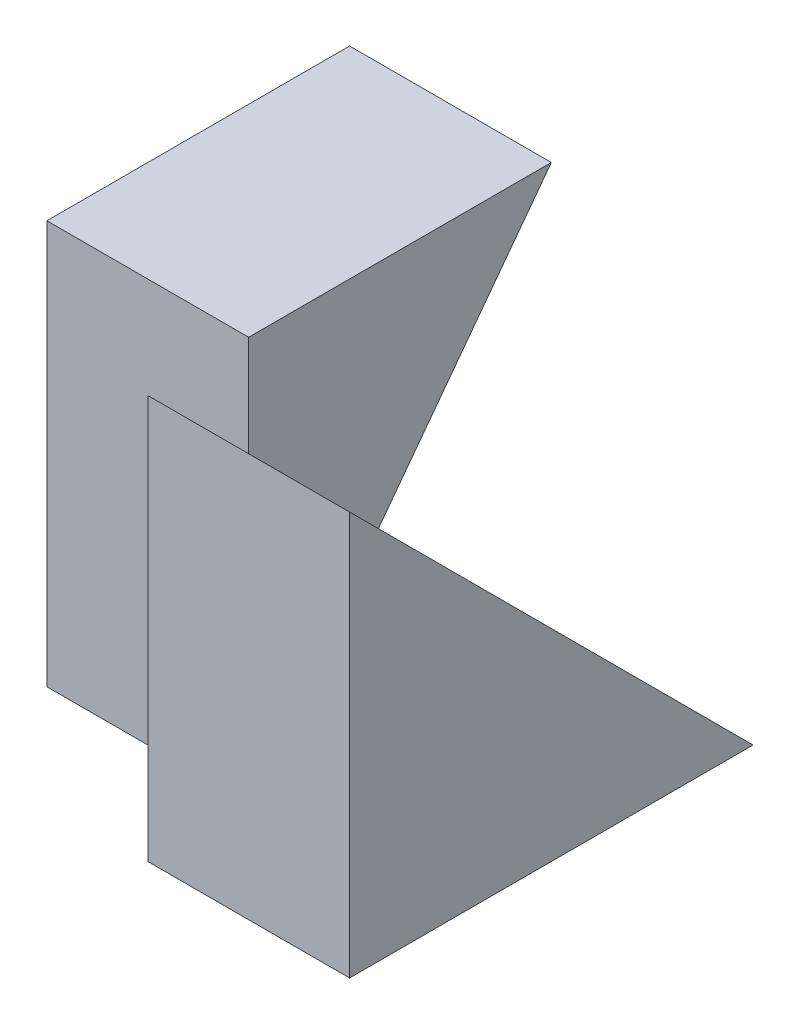
ISO-10303-21;
HEADER;
FILE_DESCRIPTION(('STEP AP214'),'2;1');
FILE_NAME('part.step','',(''),(''),'','','');
FILE_SCHEMA(('AUTOMOTIVE_DESIGN { 1 0 10303 214 1 1 1 1 }'));
ENDSEC;
DATA;
#1=APPLICATION_CONTEXT('core data for automotive mechanical design processes');
#2=APPLICATION_PROTOCOL_DEFINITION('international standard','automotive_design',2000,#1);
#3=PRODUCT_CONTEXT('',#1,'mechanical');
#4=PRODUCT('Part','Part','',(#3));
#5=PRODUCT_RELATED_PRODUCT_CATEGORY('part','',(#4));
#6=PRODUCT_DEFINITION_FORMATION('','',#4);
#7=PRODUCT_DEFINITION_CONTEXT('part definition',#1,'design');
#8=PRODUCT_DEFINITION('design','',#6,#7);
#9=PRODUCT_DEFINITION_SHAPE('','',#8);
#10=(LENGTH_UNIT() NAMED_UNIT(*) SI_UNIT(.MILLI.,.METRE.));
#11=(NAMED_UNIT(*) PLANE_ANGLE_UNIT() SI_UNIT($,.RADIAN.));
#12=(NAMED_UNIT(*) SI_UNIT($,.STERADIAN.) SOLID_ANGLE_UNIT());
#13=UNCERTAINTY_MEASURE_WITH_UNIT(LENGTH_MEASURE(1.E-05),#10,'distance_accuracy_value','');
#14=(GEOMETRIC_REPRESENTATION_CONTEXT(3) GLOBAL_UNCERTAINTY_ASSIGNED_CONTEXT((#13)) GLOBAL_UNIT_ASSIGNED_CONTEXT((#10,
#11,#12)) REPRESENTATION_CONTEXT('',''));
#15=CARTESIAN_POINT('',(0.,0.,0.));
#16=DIRECTION('',(0.,0.,1.));
#17=DIRECTION('',(1.,0.,0.));
#18=AXIS2_PLACEMENT_3D('',#15,#16,#17);
#19=CARTESIAN_POINT('',(2.,0.,0.));
#20=DIRECTION('',(0.,1.,0.));
#21=DIRECTION('',(0.,0.,1.));
#22=AXIS2_PLACEMENT_3D('',#19,#20,#21);
#23=PLANE('',#22);
#24=DIRECTION('',(0.,0.,1.));
#25=VECTOR('',#24,1.);
#26=CARTESIAN_POINT('',(0.,0.,0.));
#27=LINE('',#26,#25);
#28=CARTESIAN_POINT('',(0.,0.,-4.));
#29=VERTEX_POINT('',#28);
#30=CARTESIAN_POINT('',(0.,0.,-1.));
#31=VERTEX_POINT('',#30);
#32=EDGE_CURVE('E103',#29,#31,#27,.T.);
#33=ORIENTED_EDGE('',*,*,#32,.F.);
#34=DIRECTION('',(-1.,0.,0.));
#35=VECTOR('',#34,1.);
#36=CARTESIAN_POINT('',(2.,0.,-4.));
#37=LINE('',#36,#35);
#38=CARTESIAN_POINT('',(2.,0.,-4.));
#39=VERTEX_POINT('',#38);
#40=EDGE_CURVE('E42',#39,#29,#37,.T.);
#41=ORIENTED_EDGE('',*,*,#40,.F.);
#42=DIRECTION('',(0.,0.,-1.));
#43=VECTOR('',#42,1.);
#44=CARTESIAN_POINT('',(2.,0.,0.));
#45=LINE('',#44,#43);
#46=CARTESIAN_POINT('',(2.,0.,0.));
#47=VERTEX_POINT('',#46);
#48=EDGE_CURVE('E58',#47,#39,#45,.T.);
#49=ORIENTED_EDGE('',*,*,#48,.F.);
#50=DIRECTION('',(-1.,0.,0.));
#51=VECTOR('',#50,1.);
#52=CARTESIAN_POINT('',(2.,0.,0.));
#53=LINE('',#52,#51);
#54=CARTESIAN_POINT('',(0.,0.,0.));
#55=VERTEX_POINT('',#54);
#56=EDGE_CURVE('E11',#47,#55,#53,.T.);
#57=ORIENTED_EDGE('',*,*,#56,.T.);
#58=DIRECTION('',(0.,0.,-1.));
#59=VECTOR('',#58,1.);
#60=CARTESIAN_POINT('',(0.,0.,0.));
#61=LINE('',#60,#59);
#62=EDGE_CURVE('E116',#55,#31,#61,.T.);
#63=ORIENTED_EDGE('',*,*,#62,.T.);
#64=EDGE_LOOP('',(#33,#41,#49,#57,#63));
#65=FACE_BOUND('',#64,.T.);
#66=ADVANCED_FACE('F33',(#65),#23,.F.);
#67=CARTESIAN_POINT('',(2.,4.,0.));
#68=DIRECTION('',(0.,-1.,0.));
#69=DIRECTION('',(0.,0.,-1.));
#70=AXIS2_PLACEMENT_3D('',#67,#68,#69);
#71=PLANE('',#70);
#72=DIRECTION('',(0.,0.,1.));
#73=VECTOR('',#72,1.);
#74=CARTESIAN_POINT('',(0.,3.99999999999996,0.));
#75=LINE('',#74,#73);
#76=CARTESIAN_POINT('',(0.,4.,-4.));
#77=VERTEX_POINT('',#76);
#78=CARTESIAN_POINT('',(0.,4.,-1.));
#79=VERTEX_POINT('',#78);
#80=EDGE_CURVE('E166',#77,#79,#75,.T.);
#81=ORIENTED_EDGE('',*,*,#80,.F.);
#82=DIRECTION('',(-1.,0.,0.));
#83=VECTOR('',#82,1.);
#84=CARTESIAN_POINT('',(2.,4.,-4.));
#85=LINE('',#84,#83);
#86=CARTESIAN_POINT('',(-2.,4.,-4.));
#87=VERTEX_POINT('',#86);
#88=EDGE_CURVE('E157',#77,#87,#85,.T.);
#89=ORIENTED_EDGE('',*,*,#88,.T.);
#90=DIRECTION('',(0.,0.,-1.));
#91=VECTOR('',#90,1.);
#92=CARTESIAN_POINT('',(-2.,4.,-1.));
#93=LINE('',#92,#91);
#94=CARTESIAN_POINT('',(-2.,4.,-1.));
#95=VERTEX_POINT('',#94);
#96=EDGE_CURVE('E135',#95,#87,#93,.T.);
#97=ORIENTED_EDGE('',*,*,#96,.F.);
#98=DIRECTION('',(1.,0.,0.));
#99=VECTOR('',#98,1.);
#100=CARTESIAN_POINT('',(-2.,4.,-1.));
#101=LINE('',#100,#99);
#102=EDGE_CURVE('E131',#95,#79,#101,.T.);
#103=ORIENTED_EDGE('',*,*,#102,.T.);
#104=EDGE_LOOP('',(#81,#89,#97,#103));
#105=FACE_BOUND('',#104,.T.);
#106=ADVANCED_FACE('F171',(#105),#71,.F.);
#107=CARTESIAN_POINT('',(2.,0.,0.));
#108=DIRECTION('',(0.,0.,-1.));
#109=DIRECTION('',(-1.,0.,0.));
#110=AXIS2_PLACEMENT_3D('',#107,#108,#109);
#111=PLANE('',#110);
#112=DIRECTION('',(0.,-1.,0.));
#113=VECTOR('',#112,1.);
#114=CARTESIAN_POINT('',(0.,0.,0.));
#115=LINE('',#114,#113);
#116=CARTESIAN_POINT('',(0.,3.99999999999996,0.));
#117=VERTEX_POINT('',#116);
#118=EDGE_CURVE('E126',#117,#55,#115,.T.);
#119=ORIENTED_EDGE('',*,*,#118,.T.);
#120=ORIENTED_EDGE('',*,*,#56,.F.);
#121=DIRECTION('',(0.,-1.,0.));
#122=VECTOR('',#121,1.);
#123=CARTESIAN_POINT('',(2.,0.,0.));
#124=LINE('',#123,#122);
#125=CARTESIAN_POINT('',(2.,3.99999999999996,0.));
#126=VERTEX_POINT('',#125);
#127=EDGE_CURVE('E125',#126,#47,#124,.T.);
#128=ORIENTED_EDGE('',*,*,#127,.F.);
#129=DIRECTION('',(-1.,0.,0.));
#130=VECTOR('',#129,1.);
#131=CARTESIAN_POINT('',(2.,4.,0.));
#132=LINE('',#131,#130);
#133=EDGE_CURVE('E154',#126,#117,#132,.T.);
#134=ORIENTED_EDGE('',*,*,#133,.T.);
#135=EDGE_LOOP('',(#119,#120,#128,#134));
#136=FACE_BOUND('',#135,.T.);
#137=ADVANCED_FACE('F35',(#136),#111,.F.);
#138=CARTESIAN_POINT('',(2.,0.,0.));
#139=DIRECTION('',(-1.,0.,0.));
#140=DIRECTION('',(0.,0.,1.));
#141=AXIS2_PLACEMENT_3D('',#138,#139,#140);
#142=PLANE('',#141);
#143=ORIENTED_EDGE('',*,*,#48,.T.);
#144=DIRECTION('',(0.,-0.707106781186544,-0.707106781186551));
#145=VECTOR('',#144,1.);
#146=CARTESIAN_POINT('',(2.,0.,-4.));
#147=LINE('',#146,#145);
#148=EDGE_CURVE('E100',#126,#39,#147,.T.);
#149=ORIENTED_EDGE('',*,*,#148,.F.);
#150=ORIENTED_EDGE('',*,*,#127,.T.);
#151=EDGE_LOOP('',(#143,#149,#150));
#152=FACE_BOUND('',#151,.T.);
#153=ADVANCED_FACE('F168',(#152),#142,.F.);
#154=CARTESIAN_POINT('',(0.,0.,0.));
#155=DIRECTION('',(-1.,0.,0.));
#156=DIRECTION('',(0.,0.,1.));
#157=AXIS2_PLACEMENT_3D('',#154,#155,#156);
#158=PLANE('',#157);
#159=DIRECTION('',(0.,-0.707106781186544,-0.707106781186551));
#160=VECTOR('',#159,1.);
#161=CARTESIAN_POINT('',(0.,0.,-4.));
#162=LINE('',#161,#160);
#163=CARTESIAN_POINT('',(0.,2.99999999999997,-1.));
#164=VERTEX_POINT('',#163);
#165=EDGE_CURVE('E117',#117,#164,#162,.T.);
#166=ORIENTED_EDGE('',*,*,#165,.T.);
#167=DIRECTION('',(0.,1.,0.));
#168=VECTOR('',#167,1.);
#169=CARTESIAN_POINT('',(0.,0.,-1.));
#170=LINE('',#169,#168);
#171=EDGE_CURVE('E113',#31,#164,#170,.T.);
#172=ORIENTED_EDGE('',*,*,#171,.F.);
#173=ORIENTED_EDGE('',*,*,#62,.F.);
#174=ORIENTED_EDGE('',*,*,#118,.F.);
#175=EDGE_LOOP('',(#166,#172,#173,#174));
#176=FACE_BOUND('',#175,.T.);
#177=ADVANCED_FACE('F114',(#176),#158,.T.);
#178=CARTESIAN_POINT('',(-2.,0.,-1.));
#179=DIRECTION('',(0.,0.,-1.));
#180=DIRECTION('',(-1.,0.,0.));
#181=AXIS2_PLACEMENT_3D('',#178,#179,#180);
#182=PLANE('',#181);
#183=ORIENTED_EDGE('',*,*,#171,.T.);
#184=EDGE_CURVE('E121',#164,#79,#170,.T.);
#185=ORIENTED_EDGE('',*,*,#184,.T.);
#186=ORIENTED_EDGE('',*,*,#102,.F.);
#187=DIRECTION('',(0.,1.,0.));
#188=VECTOR('',#187,1.);
#189=CARTESIAN_POINT('',(-2.,0.,-1.));
#190=LINE('',#189,#188);
#191=CARTESIAN_POINT('',(-2.,0.,-1.));
#192=VERTEX_POINT('',#191);
#193=EDGE_CURVE('E120',#192,#95,#190,.T.);
#194=ORIENTED_EDGE('',*,*,#193,.F.);
#195=DIRECTION('',(1.,0.,0.));
#196=VECTOR('',#195,1.);
#197=CARTESIAN_POINT('',(-2.,0.,-1.));
#198=LINE('',#197,#196);
#199=EDGE_CURVE('E95',#192,#31,#198,.T.);
#200=ORIENTED_EDGE('',*,*,#199,.T.);
#201=EDGE_LOOP('',(#183,#185,#186,#194,#200));
#202=FACE_BOUND('',#201,.T.);
#203=ADVANCED_FACE('F129',(#202),#182,.F.);
#204=CARTESIAN_POINT('',(-2.,0.,0.));
#205=DIRECTION('',(-1.,0.,0.));
#206=DIRECTION('',(0.,0.,1.));
#207=AXIS2_PLACEMENT_3D('',#204,#205,#206);
#208=PLANE('',#207);
#209=DIRECTION('',(0.,0.8,-0.6));
#210=VECTOR('',#209,1.);
#211=CARTESIAN_POINT('',(-2.,-0.48,-0.64));
#212=LINE('',#211,#210);
#213=EDGE_CURVE('E109',#192,#87,#212,.T.);
#214=ORIENTED_EDGE('',*,*,#213,.F.);
#215=ORIENTED_EDGE('',*,*,#193,.T.);
#216=ORIENTED_EDGE('',*,*,#96,.T.);
#217=EDGE_LOOP('',(#214,#215,#216));
#218=FACE_BOUND('',#217,.T.);
#219=ADVANCED_FACE('F187',(#218),#208,.T.);
#220=CARTESIAN_POINT('',(0.,0.,0.));
#221=DIRECTION('',(1.,0.,0.));
#222=DIRECTION('',(0.,0.,-1.));
#223=AXIS2_PLACEMENT_3D('',#220,#221,#222);
#224=PLANE('',#223);
#225=DIRECTION('',(0.,0.8,-0.6));
#226=VECTOR('',#225,1.);
#227=CARTESIAN_POINT('',(0.,-0.48,-0.64));
#228=LINE('',#227,#226);
#229=CARTESIAN_POINT('',(0.,1.7142857142857,-2.28571428571428));
#230=VERTEX_POINT('',#229);
#231=EDGE_CURVE('E98',#230,#77,#228,.T.);
#232=ORIENTED_EDGE('',*,*,#231,.T.);
#233=ORIENTED_EDGE('',*,*,#80,.T.);
#234=ORIENTED_EDGE('',*,*,#184,.F.);
#235=EDGE_CURVE('E269',#164,#230,#162,.T.);
#236=ORIENTED_EDGE('',*,*,#235,.T.);
#237=EDGE_LOOP('',(#232,#233,#234,#236));
#238=FACE_BOUND('',#237,.T.);
#239=ADVANCED_FACE('F190',(#238),#224,.T.);
#240=CARTESIAN_POINT('',(0.,0.,-4.));
#241=DIRECTION('',(0.,-0.707106781186551,0.707106781186544));
#242=DIRECTION('',(0.,-0.707106781186544,-0.707106781186551));
#243=AXIS2_PLACEMENT_3D('',#240,#241,#242);
#244=PLANE('',#243);
#245=ORIENTED_EDGE('',*,*,#148,.T.);
#246=ORIENTED_EDGE('',*,*,#40,.T.);
#247=EDGE_CURVE('E106',#230,#29,#162,.T.);
#248=ORIENTED_EDGE('',*,*,#247,.F.);
#249=ORIENTED_EDGE('',*,*,#235,.F.);
#250=ORIENTED_EDGE('',*,*,#165,.F.);
#251=ORIENTED_EDGE('',*,*,#133,.F.);
#252=EDGE_LOOP('',(#245,#246,#248,#249,#250,#251));
#253=FACE_BOUND('',#252,.T.);
#254=ADVANCED_FACE('F160',(#253),#244,.F.);
#255=CARTESIAN_POINT('',(0.,0.,0.));
#256=DIRECTION('',(-1.,0.,0.));
#257=DIRECTION('',(0.,0.,1.));
#258=AXIS2_PLACEMENT_3D('',#255,#256,#257);
#259=PLANE('',#258);
#260=ORIENTED_EDGE('',*,*,#247,.T.);
#261=ORIENTED_EDGE('',*,*,#32,.T.);
#262=EDGE_CURVE('E50',#31,#230,#228,.T.);
#263=ORIENTED_EDGE('',*,*,#262,.T.);
#264=EDGE_LOOP('',(#260,#261,#263));
#265=FACE_BOUND('',#264,.T.);
#266=ADVANCED_FACE('F105',(#265),#259,.T.);
#267=CARTESIAN_POINT('',(0.,-0.48,-0.64));
#268=DIRECTION('',(0.,0.6,0.8));
#269=DIRECTION('',(0.,-0.8,0.6));
#270=AXIS2_PLACEMENT_3D('',#267,#268,#269);
#271=PLANE('',#270);
#272=ORIENTED_EDGE('',*,*,#213,.T.);
#273=ORIENTED_EDGE('',*,*,#88,.F.);
#274=ORIENTED_EDGE('',*,*,#231,.F.);
#275=ORIENTED_EDGE('',*,*,#262,.F.);
#276=ORIENTED_EDGE('',*,*,#199,.F.);
#277=EDGE_LOOP('',(#272,#273,#274,#275,#276));
#278=FACE_BOUND('',#277,.T.);
#279=ADVANCED_FACE('F93',(#278),#271,.F.);
#280=CLOSED_SHELL('',(#66,#106,#137,#153,#177,#203,#219,#239,#254,#266,#279));
#281=MANIFOLD_SOLID_BREP('B2',#280);
#282=ADVANCED_BREP_SHAPE_REPRESENTATION('',(#18,#281),#14);
#283=SHAPE_DEFINITION_REPRESENTATION(#9,#282);
ENDSEC;
END-ISO-10303-21;
